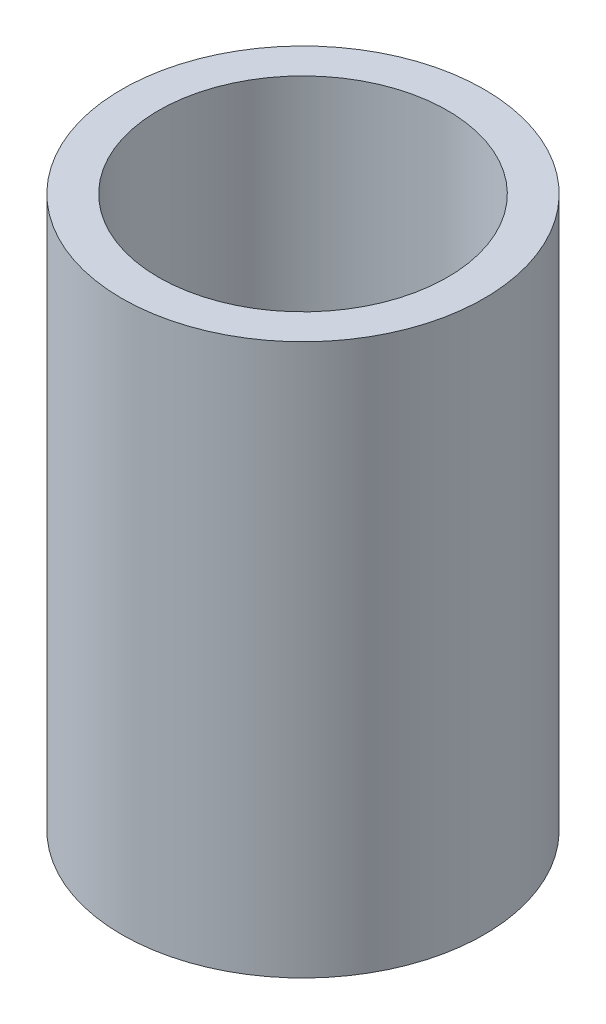
ISO-10303-21;
HEADER;
FILE_DESCRIPTION(('STEP AP214'),'2;1');
FILE_NAME('part.step','',(''),(''),'','','');
FILE_SCHEMA(('AUTOMOTIVE_DESIGN { 1 0 10303 214 1 1 1 1 }'));
ENDSEC;
DATA;
#1=APPLICATION_CONTEXT('core data for automotive mechanical design processes');
#2=APPLICATION_PROTOCOL_DEFINITION('international standard','automotive_design',2000,#1);
#3=PRODUCT_CONTEXT('',#1,'mechanical');
#4=PRODUCT('Part','Part','',(#3));
#5=PRODUCT_RELATED_PRODUCT_CATEGORY('part','',(#4));
#6=PRODUCT_DEFINITION_FORMATION('','',#4);
#7=PRODUCT_DEFINITION_CONTEXT('part definition',#1,'design');
#8=PRODUCT_DEFINITION('design','',#6,#7);
#9=PRODUCT_DEFINITION_SHAPE('','',#8);
#10=(LENGTH_UNIT() NAMED_UNIT(*) SI_UNIT(.MILLI.,.METRE.));
#11=(NAMED_UNIT(*) PLANE_ANGLE_UNIT() SI_UNIT($,.RADIAN.));
#12=(NAMED_UNIT(*) SI_UNIT($,.STERADIAN.) SOLID_ANGLE_UNIT());
#13=UNCERTAINTY_MEASURE_WITH_UNIT(LENGTH_MEASURE(1.E-05),#10,'distance_accuracy_value','');
#14=(GEOMETRIC_REPRESENTATION_CONTEXT(3) GLOBAL_UNCERTAINTY_ASSIGNED_CONTEXT((#13)) GLOBAL_UNIT_ASSIGNED_CONTEXT((#10,
#11,#12)) REPRESENTATION_CONTEXT('',''));
#15=CARTESIAN_POINT('',(0.,0.,0.));
#16=DIRECTION('',(0.,0.,1.));
#17=DIRECTION('',(1.,0.,0.));
#18=AXIS2_PLACEMENT_3D('',#15,#16,#17);
#19=CARTESIAN_POINT('',(0.,50.8,0.));
#20=DIRECTION('',(0.,1.,0.));
#21=DIRECTION('',(0.,0.,1.));
#22=AXIS2_PLACEMENT_3D('',#19,#20,#21);
#23=PLANE('',#22);
#24=CARTESIAN_POINT('',(0.,50.8,0.));
#25=DIRECTION('',(0.,1.,0.));
#26=DIRECTION('',(0.,0.,1.));
#27=AXIS2_PLACEMENT_3D('',#24,#25,#26);
#28=CIRCLE('',#27,16.7005);
#29=CARTESIAN_POINT('',(0.,50.8,16.7005));
#30=VERTEX_POINT('',#29);
#31=EDGE_CURVE('E10',#30,#30,#28,.T.);
#32=ORIENTED_EDGE('',*,*,#31,.T.);
#33=EDGE_LOOP('',(#32));
#34=FACE_BOUND('',#33,.T.);
#35=CARTESIAN_POINT('',(0.,50.8,0.));
#36=DIRECTION('',(0.,1.,0.));
#37=DIRECTION('',(0.,0.,1.));
#38=AXIS2_PLACEMENT_3D('',#35,#36,#37);
#39=CIRCLE('',#38,13.3223);
#40=CARTESIAN_POINT('',(0.,50.8,13.3223));
#41=VERTEX_POINT('',#40);
#42=EDGE_CURVE('E42',#41,#41,#39,.T.);
#43=ORIENTED_EDGE('',*,*,#42,.F.);
#44=EDGE_LOOP('',(#43));
#45=FACE_BOUND('',#44,.T.);
#46=ADVANCED_FACE('F31',(#34,#45),#23,.T.);
#47=CARTESIAN_POINT('',(0.,0.,0.));
#48=DIRECTION('',(0.,1.,0.));
#49=DIRECTION('',(0.,0.,1.));
#50=AXIS2_PLACEMENT_3D('',#47,#48,#49);
#51=PLANE('',#50);
#52=CARTESIAN_POINT('',(0.,0.,0.));
#53=DIRECTION('',(0.,1.,0.));
#54=DIRECTION('',(0.,0.,1.));
#55=AXIS2_PLACEMENT_3D('',#52,#53,#54);
#56=CIRCLE('',#55,16.7005);
#57=CARTESIAN_POINT('',(0.,0.,16.7005));
#58=VERTEX_POINT('',#57);
#59=EDGE_CURVE('E35',#58,#58,#56,.T.);
#60=ORIENTED_EDGE('',*,*,#59,.F.);
#61=EDGE_LOOP('',(#60));
#62=FACE_BOUND('',#61,.T.);
#63=CARTESIAN_POINT('',(0.,0.,0.));
#64=DIRECTION('',(0.,1.,0.));
#65=DIRECTION('',(0.,0.,1.));
#66=AXIS2_PLACEMENT_3D('',#63,#64,#65);
#67=CIRCLE('',#66,13.3223);
#68=CARTESIAN_POINT('',(0.,0.,13.3223));
#69=VERTEX_POINT('',#68);
#70=EDGE_CURVE('E44',#69,#69,#67,.T.);
#71=ORIENTED_EDGE('',*,*,#70,.T.);
#72=EDGE_LOOP('',(#71));
#73=FACE_BOUND('',#72,.T.);
#74=ADVANCED_FACE('F54',(#62,#73),#51,.F.);
#75=CARTESIAN_POINT('',(0.,50.8,0.));
#76=DIRECTION('',(0.,-1.,0.));
#77=DIRECTION('',(0.,0.,-1.));
#78=AXIS2_PLACEMENT_3D('',#75,#76,#77);
#79=CYLINDRICAL_SURFACE('',#78,16.7005);
#80=ORIENTED_EDGE('',*,*,#31,.F.);
#81=EDGE_LOOP('',(#80));
#82=FACE_BOUND('',#81,.T.);
#83=ORIENTED_EDGE('',*,*,#59,.T.);
#84=EDGE_LOOP('',(#83));
#85=FACE_BOUND('',#84,.T.);
#86=ADVANCED_FACE('F33',(#82,#85),#79,.T.);
#87=CARTESIAN_POINT('',(0.,50.8,0.));
#88=DIRECTION('',(0.,-1.,0.));
#89=DIRECTION('',(0.,0.,-1.));
#90=AXIS2_PLACEMENT_3D('',#87,#88,#89);
#91=CYLINDRICAL_SURFACE('',#90,13.3223);
#92=ORIENTED_EDGE('',*,*,#42,.T.);
#93=EDGE_LOOP('',(#92));
#94=FACE_BOUND('',#93,.T.);
#95=ORIENTED_EDGE('',*,*,#70,.F.);
#96=EDGE_LOOP('',(#95));
#97=FACE_BOUND('',#96,.T.);
#98=ADVANCED_FACE('F50',(#94,#97),#91,.F.);
#99=CLOSED_SHELL('',(#46,#74,#86,#98));
#100=MANIFOLD_SOLID_BREP('B2',#99);
#101=ADVANCED_BREP_SHAPE_REPRESENTATION('',(#18,#100),#14);
#102=SHAPE_DEFINITION_REPRESENTATION(#9,#101);
ENDSEC;
END-ISO-10303-21;
